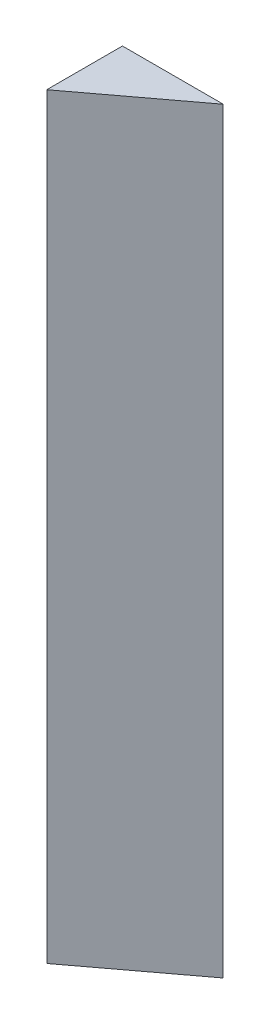
ISO-10303-21;
HEADER;
FILE_DESCRIPTION(('STEP AP214'),'2;1');
FILE_NAME('part.step','',(''),(''),'','','');
FILE_SCHEMA(('AUTOMOTIVE_DESIGN { 1 0 10303 214 1 1 1 1 }'));
ENDSEC;
DATA;
#1=APPLICATION_CONTEXT('core data for automotive mechanical design processes');
#2=APPLICATION_PROTOCOL_DEFINITION('international standard','automotive_design',2000,#1);
#3=PRODUCT_CONTEXT('',#1,'mechanical');
#4=PRODUCT('Part','Part','',(#3));
#5=PRODUCT_RELATED_PRODUCT_CATEGORY('part','',(#4));
#6=PRODUCT_DEFINITION_FORMATION('','',#4);
#7=PRODUCT_DEFINITION_CONTEXT('part definition',#1,'design');
#8=PRODUCT_DEFINITION('design','',#6,#7);
#9=PRODUCT_DEFINITION_SHAPE('','',#8);
#10=(LENGTH_UNIT() NAMED_UNIT(*) SI_UNIT(.MILLI.,.METRE.));
#11=(NAMED_UNIT(*) PLANE_ANGLE_UNIT() SI_UNIT($,.RADIAN.));
#12=(NAMED_UNIT(*) SI_UNIT($,.STERADIAN.) SOLID_ANGLE_UNIT());
#13=UNCERTAINTY_MEASURE_WITH_UNIT(LENGTH_MEASURE(1.E-05),#10,'distance_accuracy_value','');
#14=(GEOMETRIC_REPRESENTATION_CONTEXT(3) GLOBAL_UNCERTAINTY_ASSIGNED_CONTEXT((#13)) GLOBAL_UNIT_ASSIGNED_CONTEXT((#10,
#11,#12)) REPRESENTATION_CONTEXT('',''));
#15=CARTESIAN_POINT('',(0.,0.,0.));
#16=DIRECTION('',(0.,0.,1.));
#17=DIRECTION('',(1.,0.,0.));
#18=AXIS2_PLACEMENT_3D('',#15,#16,#17);
#19=CARTESIAN_POINT('',(-3.906661108732,1.74999970334389,-2.35778247673823));
#20=DIRECTION('',(0.,-1.,-8.74227765734759E-08));
#21=DIRECTION('',(1.,0.,0.));
#22=AXIS2_PLACEMENT_3D('',#19,#20,#21);
#23=PLANE('',#22);
#24=DIRECTION('',(1.,0.,0.));
#25=VECTOR('',#24,1.);
#26=CARTESIAN_POINT('',(-3.9,1.74999970276156,-2.35112136800623));
#27=LINE('',#26,#25);
#28=CARTESIAN_POINT('',(-3.9,1.74999970276056,-2.35112136800623));
#29=VERTEX_POINT('',#28);
#30=CARTESIAN_POINT('',(-3.766777825356,1.74999970276056,-2.35112136800623));
#31=VERTEX_POINT('',#30);
#32=EDGE_CURVE('E11',#29,#31,#27,.T.);
#33=ORIENTED_EDGE('',*,*,#32,.F.);
#34=DIRECTION('',(0.,8.74227756852974E-08,-0.999999999999996));
#35=VECTOR('',#34,1.);
#36=CARTESIAN_POINT('',(-3.9,1.74999969401928,-2.25112136800623));
#37=LINE('',#36,#35);
#38=CARTESIAN_POINT('',(-3.9,1.74999969401828,-2.25112136800623));
#39=VERTEX_POINT('',#38);
#40=EDGE_CURVE('E63',#39,#29,#37,.T.);
#41=ORIENTED_EDGE('',*,*,#40,.F.);
#42=DIRECTION('',(-0.799759704949036,-5.24816634128169E-08,0.600320259811234));
#43=VECTOR('',#42,1.);
#44=CARTESIAN_POINT('',(-3.766777825356,1.74999970276156,-2.35112136800623));
#45=LINE('',#44,#43);
#46=EDGE_CURVE('E70',#31,#39,#45,.T.);
#47=ORIENTED_EDGE('',*,*,#46,.F.);
#48=EDGE_LOOP('',(#33,#41,#47));
#49=FACE_BOUND('',#48,.T.);
#50=ADVANCED_FACE('F17',(#49),#23,.F.);
#51=CARTESIAN_POINT('',(-3.906661108732,0.749999703343892,-2.35778256416101));
#52=DIRECTION('',(0.,-1.,-8.74227765734759E-08));
#53=DIRECTION('',(1.,0.,0.));
#54=AXIS2_PLACEMENT_3D('',#51,#52,#53);
#55=PLANE('',#54);
#56=DIRECTION('',(-0.799759704949037,-5.24816640793062E-08,0.600320259811233));
#57=VECTOR('',#56,1.);
#58=CARTESIAN_POINT('',(-3.766777825356,0.74999970276156,-2.35112145542901));
#59=LINE('',#58,#57);
#60=CARTESIAN_POINT('',(-3.766777825356,0.74999970276256,-2.35112145542901));
#61=VERTEX_POINT('',#60);
#62=CARTESIAN_POINT('',(-3.9,0.749999694020282,-2.25112145542901));
#63=VERTEX_POINT('',#62);
#64=EDGE_CURVE('E24',#61,#63,#59,.T.);
#65=ORIENTED_EDGE('',*,*,#64,.T.);
#66=DIRECTION('',(0.,8.74227767955201E-08,-0.999999999999996));
#67=VECTOR('',#66,1.);
#68=CARTESIAN_POINT('',(-3.9,0.749999694019282,-2.25112145542901));
#69=LINE('',#68,#67);
#70=CARTESIAN_POINT('',(-3.9,0.74999970276256,-2.35112145542901));
#71=VERTEX_POINT('',#70);
#72=EDGE_CURVE('E49',#63,#71,#69,.T.);
#73=ORIENTED_EDGE('',*,*,#72,.T.);
#74=DIRECTION('',(1.,0.,0.));
#75=VECTOR('',#74,1.);
#76=CARTESIAN_POINT('',(-3.9,0.74999970276156,-2.35112145542901));
#77=LINE('',#76,#75);
#78=EDGE_CURVE('E46',#71,#61,#77,.T.);
#79=ORIENTED_EDGE('',*,*,#78,.T.);
#80=EDGE_LOOP('',(#65,#73,#79));
#81=FACE_BOUND('',#80,.T.);
#82=ADVANCED_FACE('F47',(#81),#55,.T.);
#83=CARTESIAN_POINT('',(-3.766777825356,1.74999970276156,-2.35112136800623));
#84=DIRECTION('',(0.600320259811235,-6.99172139982287E-08,0.799759704949038));
#85=DIRECTION('',(-0.799759704949038,-5.24816639460086E-08,0.600320259811235));
#86=AXIS2_PLACEMENT_3D('',#83,#84,#85);
#87=PLANE('',#86);
#88=ORIENTED_EDGE('',*,*,#46,.T.);
#89=DIRECTION('',(0.,-0.999999999999996,-8.74227765734755E-08));
#90=VECTOR('',#89,1.);
#91=CARTESIAN_POINT('',(-3.9,1.74999969401928,-2.25112136800623));
#92=LINE('',#91,#90);
#93=EDGE_CURVE('E54',#39,#63,#92,.T.);
#94=ORIENTED_EDGE('',*,*,#93,.T.);
#95=ORIENTED_EDGE('',*,*,#64,.F.);
#96=DIRECTION('',(0.,-0.999999999999996,-8.74227765734755E-08));
#97=VECTOR('',#96,1.);
#98=CARTESIAN_POINT('',(-3.766777825356,1.74999970276156,-2.35112136800623));
#99=LINE('',#98,#97);
#100=EDGE_CURVE('E61',#31,#61,#99,.T.);
#101=ORIENTED_EDGE('',*,*,#100,.F.);
#102=EDGE_LOOP('',(#88,#94,#95,#101));
#103=FACE_BOUND('',#102,.T.);
#104=ADVANCED_FACE('F60',(#103),#87,.T.);
#105=CARTESIAN_POINT('',(-3.9,1.74999969401928,-2.25112136800623));
#106=DIRECTION('',(-1.,0.,0.));
#107=DIRECTION('',(0.,8.74227765734759E-08,-1.));
#108=AXIS2_PLACEMENT_3D('',#105,#106,#107);
#109=PLANE('',#108);
#110=ORIENTED_EDGE('',*,*,#40,.T.);
#111=DIRECTION('',(0.,-0.999999999999996,-8.74227765734755E-08));
#112=VECTOR('',#111,1.);
#113=CARTESIAN_POINT('',(-3.9,1.74999970276156,-2.35112136800623));
#114=LINE('',#113,#112);
#115=EDGE_CURVE('E55',#29,#71,#114,.T.);
#116=ORIENTED_EDGE('',*,*,#115,.T.);
#117=ORIENTED_EDGE('',*,*,#72,.F.);
#118=ORIENTED_EDGE('',*,*,#93,.F.);
#119=EDGE_LOOP('',(#110,#116,#117,#118));
#120=FACE_BOUND('',#119,.T.);
#121=ADVANCED_FACE('F73',(#120),#109,.T.);
#122=CARTESIAN_POINT('',(-3.9,1.74999970276156,-2.35112136800623));
#123=DIRECTION('',(0.,8.74227765734759E-08,-1.));
#124=DIRECTION('',(1.,0.,0.));
#125=AXIS2_PLACEMENT_3D('',#122,#123,#124);
#126=PLANE('',#125);
#127=ORIENTED_EDGE('',*,*,#32,.T.);
#128=ORIENTED_EDGE('',*,*,#100,.T.);
#129=ORIENTED_EDGE('',*,*,#78,.F.);
#130=ORIENTED_EDGE('',*,*,#115,.F.);
#131=EDGE_LOOP('',(#127,#128,#129,#130));
#132=FACE_BOUND('',#131,.T.);
#133=ADVANCED_FACE('F64',(#132),#126,.T.);
#134=CLOSED_SHELL('',(#50,#82,#104,#121,#133));
#135=MANIFOLD_SOLID_BREP('B1',#134);
#136=ADVANCED_BREP_SHAPE_REPRESENTATION('',(#18,#135),#14);
#137=SHAPE_DEFINITION_REPRESENTATION(#9,#136);
ENDSEC;
END-ISO-10303-21;
